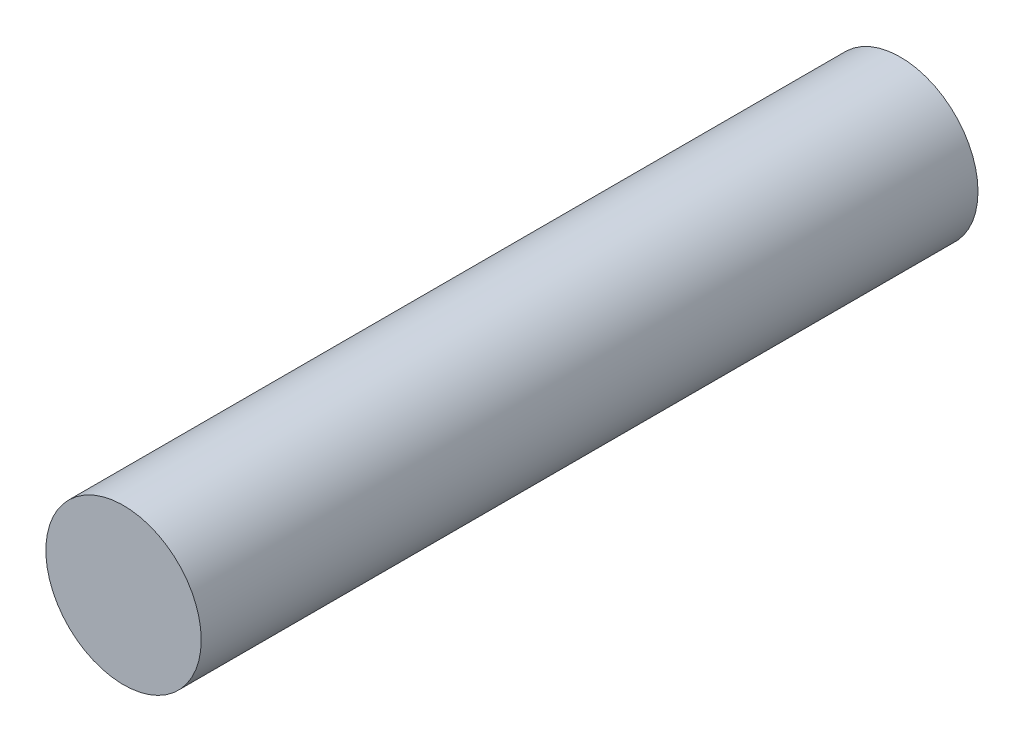
ISO-10303-21;
HEADER;
FILE_DESCRIPTION(('STEP AP214'),'2;1');
FILE_NAME('part.step','',(''),(''),'','','');
FILE_SCHEMA(('AUTOMOTIVE_DESIGN { 1 0 10303 214 1 1 1 1 }'));
ENDSEC;
DATA;
#1=APPLICATION_CONTEXT('core data for automotive mechanical design processes');
#2=APPLICATION_PROTOCOL_DEFINITION('international standard','automotive_design',2000,#1);
#3=PRODUCT_CONTEXT('',#1,'mechanical');
#4=PRODUCT('Part','Part','',(#3));
#5=PRODUCT_RELATED_PRODUCT_CATEGORY('part','',(#4));
#6=PRODUCT_DEFINITION_FORMATION('','',#4);
#7=PRODUCT_DEFINITION_CONTEXT('part definition',#1,'design');
#8=PRODUCT_DEFINITION('design','',#6,#7);
#9=PRODUCT_DEFINITION_SHAPE('','',#8);
#10=(LENGTH_UNIT() NAMED_UNIT(*) SI_UNIT(.MILLI.,.METRE.));
#11=(NAMED_UNIT(*) PLANE_ANGLE_UNIT() SI_UNIT($,.RADIAN.));
#12=(NAMED_UNIT(*) SI_UNIT($,.STERADIAN.) SOLID_ANGLE_UNIT());
#13=UNCERTAINTY_MEASURE_WITH_UNIT(LENGTH_MEASURE(1.E-05),#10,'distance_accuracy_value','');
#14=(GEOMETRIC_REPRESENTATION_CONTEXT(3) GLOBAL_UNCERTAINTY_ASSIGNED_CONTEXT((#13)) GLOBAL_UNIT_ASSIGNED_CONTEXT((#10,
#11,#12)) REPRESENTATION_CONTEXT('',''));
#15=CARTESIAN_POINT('',(0.,0.,0.));
#16=DIRECTION('',(0.,0.,1.));
#17=DIRECTION('',(1.,0.,0.));
#18=AXIS2_PLACEMENT_3D('',#15,#16,#17);
#19=CARTESIAN_POINT('',(0.,0.,100.));
#20=DIRECTION('',(0.,0.,-1.));
#21=DIRECTION('',(-1.,0.,0.));
#22=AXIS2_PLACEMENT_3D('',#19,#20,#21);
#23=CYLINDRICAL_SURFACE('',#22,10.);
#24=CARTESIAN_POINT('',(0.,0.,100.));
#25=DIRECTION('',(0.,0.,1.));
#26=DIRECTION('',(1.,0.,0.));
#27=AXIS2_PLACEMENT_3D('',#24,#25,#26);
#28=CIRCLE('',#27,10.);
#29=CARTESIAN_POINT('',(10.,0.,100.));
#30=VERTEX_POINT('',#29);
#31=EDGE_CURVE('E10',#30,#30,#28,.T.);
#32=ORIENTED_EDGE('',*,*,#31,.F.);
#33=EDGE_LOOP('',(#32));
#34=FACE_BOUND('',#33,.T.);
#35=CARTESIAN_POINT('',(0.,0.,0.));
#36=DIRECTION('',(0.,0.,1.));
#37=DIRECTION('',(1.,0.,0.));
#38=AXIS2_PLACEMENT_3D('',#35,#36,#37);
#39=CIRCLE('',#38,10.);
#40=CARTESIAN_POINT('',(10.,0.,0.));
#41=VERTEX_POINT('',#40);
#42=EDGE_CURVE('E40',#41,#41,#39,.T.);
#43=ORIENTED_EDGE('',*,*,#42,.T.);
#44=EDGE_LOOP('',(#43));
#45=FACE_BOUND('',#44,.T.);
#46=ADVANCED_FACE('F37',(#34,#45),#23,.T.);
#47=CARTESIAN_POINT('',(0.,0.,100.));
#48=DIRECTION('',(0.,0.,1.));
#49=DIRECTION('',(1.,0.,0.));
#50=AXIS2_PLACEMENT_3D('',#47,#48,#49);
#51=PLANE('',#50);
#52=ORIENTED_EDGE('',*,*,#31,.T.);
#53=EDGE_LOOP('',(#52));
#54=FACE_BOUND('',#53,.T.);
#55=ADVANCED_FACE('F54',(#54),#51,.T.);
#56=CARTESIAN_POINT('',(0.,0.,0.));
#57=DIRECTION('',(0.,0.,1.));
#58=DIRECTION('',(1.,0.,0.));
#59=AXIS2_PLACEMENT_3D('',#56,#57,#58);
#60=PLANE('',#59);
#61=ORIENTED_EDGE('',*,*,#42,.F.);
#62=EDGE_LOOP('',(#61));
#63=FACE_BOUND('',#62,.T.);
#64=ADVANCED_FACE('F52',(#63),#60,.F.);
#65=CLOSED_SHELL('',(#46,#55,#64));
#66=MANIFOLD_SOLID_BREP('B2',#65);
#67=ADVANCED_BREP_SHAPE_REPRESENTATION('',(#18,#66),#14);
#68=SHAPE_DEFINITION_REPRESENTATION(#9,#67);
ENDSEC;
END-ISO-10303-21;
